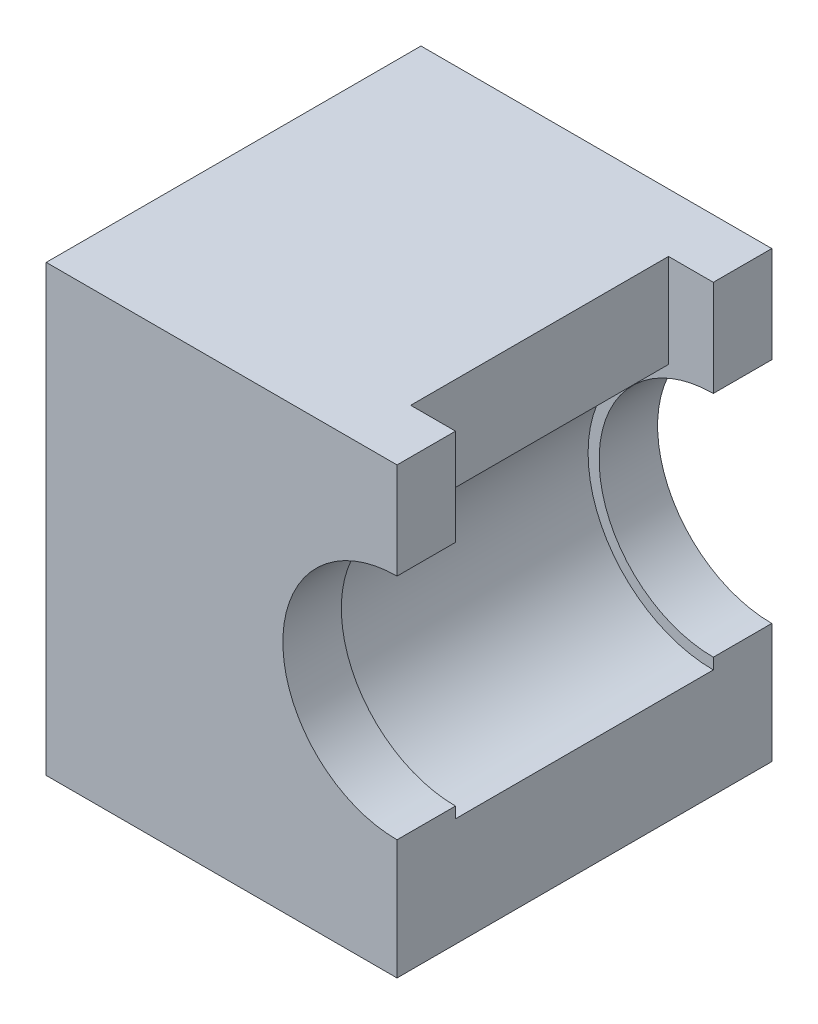
ISO-10303-21;
HEADER;
FILE_DESCRIPTION(('STEP AP214'),'2;1');
FILE_NAME('part.step','',(''),(''),'','','');
FILE_SCHEMA(('AUTOMOTIVE_DESIGN { 1 0 10303 214 1 1 1 1 }'));
ENDSEC;
DATA;
#1=APPLICATION_CONTEXT('core data for automotive mechanical design processes');
#2=APPLICATION_PROTOCOL_DEFINITION('international standard','automotive_design',2000,#1);
#3=PRODUCT_CONTEXT('',#1,'mechanical');
#4=PRODUCT('Part','Part','',(#3));
#5=PRODUCT_RELATED_PRODUCT_CATEGORY('part','',(#4));
#6=PRODUCT_DEFINITION_FORMATION('','',#4);
#7=PRODUCT_DEFINITION_CONTEXT('part definition',#1,'design');
#8=PRODUCT_DEFINITION('design','',#6,#7);
#9=PRODUCT_DEFINITION_SHAPE('','',#8);
#10=(LENGTH_UNIT() NAMED_UNIT(*) SI_UNIT(.MILLI.,.METRE.));
#11=(NAMED_UNIT(*) PLANE_ANGLE_UNIT() SI_UNIT($,.RADIAN.));
#12=(NAMED_UNIT(*) SI_UNIT($,.STERADIAN.) SOLID_ANGLE_UNIT());
#13=UNCERTAINTY_MEASURE_WITH_UNIT(LENGTH_MEASURE(1.E-05),#10,'distance_accuracy_value','');
#14=(GEOMETRIC_REPRESENTATION_CONTEXT(3) GLOBAL_UNCERTAINTY_ASSIGNED_CONTEXT((#13)) GLOBAL_UNIT_ASSIGNED_CONTEXT((#10,
#11,#12)) REPRESENTATION_CONTEXT('',''));
#15=CARTESIAN_POINT('',(0.,0.,0.));
#16=DIRECTION('',(0.,0.,1.));
#17=DIRECTION('',(1.,0.,0.));
#18=AXIS2_PLACEMENT_3D('',#15,#16,#17);
#19=CARTESIAN_POINT('',(0.,-6.35,7.));
#20=DIRECTION('',(0.,1.,0.));
#21=DIRECTION('',(0.,0.,1.));
#22=AXIS2_PLACEMENT_3D('',#19,#20,#21);
#23=PLANE('',#22);
#24=DIRECTION('',(0.,0.,-1.));
#25=VECTOR('',#24,1.);
#26=CARTESIAN_POINT('',(-9.525,-6.35,7.));
#27=LINE('',#26,#25);
#28=CARTESIAN_POINT('',(-9.525,-6.35,8.5875));
#29=VERTEX_POINT('',#28);
#30=CARTESIAN_POINT('',(-9.525,-6.35,-1.5875));
#31=VERTEX_POINT('',#30);
#32=EDGE_CURVE('E212',#29,#31,#27,.T.);
#33=ORIENTED_EDGE('',*,*,#32,.T.);
#34=DIRECTION('',(1.,0.,0.));
#35=VECTOR('',#34,1.);
#36=CARTESIAN_POINT('',(0.,-6.35,-1.5875));
#37=LINE('',#36,#35);
#38=CARTESIAN_POINT('',(0.,-6.35,-1.5875));
#39=VERTEX_POINT('',#38);
#40=EDGE_CURVE('E214',#31,#39,#37,.T.);
#41=ORIENTED_EDGE('',*,*,#40,.T.);
#42=DIRECTION('',(0.,0.,-1.));
#43=VECTOR('',#42,1.);
#44=CARTESIAN_POINT('',(0.,-6.35,7.));
#45=LINE('',#44,#43);
#46=CARTESIAN_POINT('',(0.,-6.35,8.5875));
#47=VERTEX_POINT('',#46);
#48=EDGE_CURVE('E128',#47,#39,#45,.T.);
#49=ORIENTED_EDGE('',*,*,#48,.F.);
#50=DIRECTION('',(1.,0.,0.));
#51=VECTOR('',#50,1.);
#52=CARTESIAN_POINT('',(0.,-6.35,8.5875));
#53=LINE('',#52,#51);
#54=EDGE_CURVE('E217',#29,#47,#53,.T.);
#55=ORIENTED_EDGE('',*,*,#54,.F.);
#56=EDGE_LOOP('',(#33,#41,#49,#55));
#57=FACE_BOUND('',#56,.T.);
#58=ADVANCED_FACE('F118',(#57),#23,.F.);
#59=CARTESIAN_POINT('',(0.,0.,7.));
#60=DIRECTION('',(-1.,0.,0.));
#61=DIRECTION('',(0.,0.,1.));
#62=AXIS2_PLACEMENT_3D('',#59,#60,#61);
#63=PLANE('',#62);
#64=ORIENTED_EDGE('',*,*,#48,.T.);
#65=DIRECTION('',(0.,1.,0.));
#66=VECTOR('',#65,1.);
#67=CARTESIAN_POINT('',(0.,0.,-1.5875));
#68=LINE('',#67,#66);
#69=CARTESIAN_POINT('',(0.,-3.10000000000001,-1.5875));
#70=VERTEX_POINT('',#69);
#71=EDGE_CURVE('E231',#39,#70,#68,.T.);
#72=ORIENTED_EDGE('',*,*,#71,.T.);
#73=DIRECTION('',(0.,0.,1.));
#74=VECTOR('',#73,1.);
#75=CARTESIAN_POINT('',(0.,-3.10000000000001,-1.5875));
#76=LINE('',#75,#74);
#77=CARTESIAN_POINT('',(0.,-3.10000000000001,0.));
#78=VERTEX_POINT('',#77);
#79=EDGE_CURVE('E244',#70,#78,#76,.T.);
#80=ORIENTED_EDGE('',*,*,#79,.T.);
#81=DIRECTION('',(0.,1.,0.));
#82=VECTOR('',#81,1.);
#83=CARTESIAN_POINT('',(0.,0.,0.));
#84=LINE('',#83,#82);
#85=CARTESIAN_POINT('',(0.,-3.4,0.));
#86=VERTEX_POINT('',#85);
#87=EDGE_CURVE('E232',#86,#78,#84,.T.);
#88=ORIENTED_EDGE('',*,*,#87,.F.);
#89=DIRECTION('',(0.,0.,-1.));
#90=VECTOR('',#89,1.);
#91=CARTESIAN_POINT('',(0.,-3.4,7.));
#92=LINE('',#91,#90);
#93=CARTESIAN_POINT('',(0.,-3.4,7.));
#94=VERTEX_POINT('',#93);
#95=EDGE_CURVE('E137',#94,#86,#92,.T.);
#96=ORIENTED_EDGE('',*,*,#95,.F.);
#97=DIRECTION('',(0.,1.,0.));
#98=VECTOR('',#97,1.);
#99=CARTESIAN_POINT('',(0.,0.,7.));
#100=LINE('',#99,#98);
#101=CARTESIAN_POINT('',(0.,-3.10000000000001,7.));
#102=VERTEX_POINT('',#101);
#103=EDGE_CURVE('E261',#94,#102,#100,.T.);
#104=ORIENTED_EDGE('',*,*,#103,.T.);
#105=DIRECTION('',(0.,0.,-1.));
#106=VECTOR('',#105,1.);
#107=CARTESIAN_POINT('',(0.,-3.10000000000001,8.5875));
#108=LINE('',#107,#106);
#109=CARTESIAN_POINT('',(0.,-3.10000000000001,8.5875));
#110=VERTEX_POINT('',#109);
#111=EDGE_CURVE('E290',#110,#102,#108,.T.);
#112=ORIENTED_EDGE('',*,*,#111,.F.);
#113=DIRECTION('',(0.,1.,0.));
#114=VECTOR('',#113,1.);
#115=CARTESIAN_POINT('',(0.,0.,8.5875));
#116=LINE('',#115,#114);
#117=EDGE_CURVE('E263',#47,#110,#116,.T.);
#118=ORIENTED_EDGE('',*,*,#117,.F.);
#119=EDGE_LOOP('',(#64,#72,#80,#88,#96,#104,#112,#118));
#120=FACE_BOUND('',#119,.T.);
#121=ADVANCED_FACE('F341',(#120),#63,.F.);
#122=CARTESIAN_POINT('',(0.,0.,7.));
#123=DIRECTION('',(0.,0.,-1.));
#124=DIRECTION('',(-1.,0.,0.));
#125=AXIS2_PLACEMENT_3D('',#122,#123,#124);
#126=CYLINDRICAL_SURFACE('',#125,3.4);
#127=CARTESIAN_POINT('',(0.,0.,0.));
#128=DIRECTION('',(0.,0.,1.));
#129=DIRECTION('',(1.,0.,0.));
#130=AXIS2_PLACEMENT_3D('',#127,#128,#129);
#131=CIRCLE('',#130,3.4);
#132=CARTESIAN_POINT('',(-1.21629560551701,3.175,0.));
#133=VERTEX_POINT('',#132);
#134=EDGE_CURVE('E222',#133,#86,#131,.T.);
#135=ORIENTED_EDGE('',*,*,#134,.F.);
#136=DIRECTION('',(0.,0.,-1.));
#137=VECTOR('',#136,1.);
#138=CARTESIAN_POINT('',(-1.21629560551701,3.175,7.));
#139=LINE('',#138,#137);
#140=CARTESIAN_POINT('',(-1.21629560551701,3.175,7.));
#141=VERTEX_POINT('',#140);
#142=EDGE_CURVE('E12',#141,#133,#139,.T.);
#143=ORIENTED_EDGE('',*,*,#142,.F.);
#144=CARTESIAN_POINT('',(0.,0.,7.));
#145=DIRECTION('',(0.,0.,1.));
#146=DIRECTION('',(1.,0.,0.));
#147=AXIS2_PLACEMENT_3D('',#144,#145,#146);
#148=CIRCLE('',#147,3.4);
#149=EDGE_CURVE('E293',#141,#94,#148,.T.);
#150=ORIENTED_EDGE('',*,*,#149,.T.);
#151=ORIENTED_EDGE('',*,*,#95,.T.);
#152=EDGE_LOOP('',(#135,#143,#150,#151));
#153=FACE_BOUND('',#152,.T.);
#154=ADVANCED_FACE('F336',(#153),#126,.F.);
#155=CARTESIAN_POINT('',(-9.525,3.175,7.));
#156=DIRECTION('',(1.,0.,0.));
#157=DIRECTION('',(0.,0.,-1.));
#158=AXIS2_PLACEMENT_3D('',#155,#156,#157);
#159=PLANE('',#158);
#160=DIRECTION('',(0.,0.,-1.));
#161=VECTOR('',#160,1.);
#162=CARTESIAN_POINT('',(-9.525,5.715,7.));
#163=LINE('',#162,#161);
#164=CARTESIAN_POINT('',(-9.525,5.715,8.5875));
#165=VERTEX_POINT('',#164);
#166=CARTESIAN_POINT('',(-9.525,5.715,-1.5875));
#167=VERTEX_POINT('',#166);
#168=EDGE_CURVE('E122',#165,#167,#163,.T.);
#169=ORIENTED_EDGE('',*,*,#168,.T.);
#170=DIRECTION('',(0.,-1.,0.));
#171=VECTOR('',#170,1.);
#172=CARTESIAN_POINT('',(-9.525,0.,-1.5875));
#173=LINE('',#172,#171);
#174=EDGE_CURVE('E228',#167,#31,#173,.T.);
#175=ORIENTED_EDGE('',*,*,#174,.T.);
#176=ORIENTED_EDGE('',*,*,#32,.F.);
#177=DIRECTION('',(0.,-1.,0.));
#178=VECTOR('',#177,1.);
#179=CARTESIAN_POINT('',(-9.525,0.,8.5875));
#180=LINE('',#179,#178);
#181=EDGE_CURVE('E275',#165,#29,#180,.T.);
#182=ORIENTED_EDGE('',*,*,#181,.F.);
#183=EDGE_LOOP('',(#169,#175,#176,#182));
#184=FACE_BOUND('',#183,.T.);
#185=ADVANCED_FACE('F234',(#184),#159,.F.);
#186=CARTESIAN_POINT('',(-1.21629560551701,3.175,7.));
#187=DIRECTION('',(-1.,0.,0.));
#188=DIRECTION('',(0.,0.,1.));
#189=AXIS2_PLACEMENT_3D('',#186,#187,#188);
#190=PLANE('',#189);
#191=DIRECTION('',(0.,1.,0.));
#192=VECTOR('',#191,1.);
#193=CARTESIAN_POINT('',(-1.21629560551701,3.175,0.));
#194=LINE('',#193,#192);
#195=CARTESIAN_POINT('',(-1.21629560551701,5.715,0.));
#196=VERTEX_POINT('',#195);
#197=EDGE_CURVE('E150',#133,#196,#194,.T.);
#198=ORIENTED_EDGE('',*,*,#197,.T.);
#199=DIRECTION('',(0.,0.,-1.));
#200=VECTOR('',#199,1.);
#201=CARTESIAN_POINT('',(-1.21629560551701,5.715,7.));
#202=LINE('',#201,#200);
#203=CARTESIAN_POINT('',(-1.21629560551701,5.715,7.));
#204=VERTEX_POINT('',#203);
#205=EDGE_CURVE('E153',#204,#196,#202,.T.);
#206=ORIENTED_EDGE('',*,*,#205,.F.);
#207=DIRECTION('',(0.,1.,0.));
#208=VECTOR('',#207,1.);
#209=CARTESIAN_POINT('',(-1.21629560551701,3.175,7.));
#210=LINE('',#209,#208);
#211=EDGE_CURVE('E299',#141,#204,#210,.T.);
#212=ORIENTED_EDGE('',*,*,#211,.F.);
#213=ORIENTED_EDGE('',*,*,#142,.T.);
#214=EDGE_LOOP('',(#198,#206,#212,#213));
#215=FACE_BOUND('',#214,.T.);
#216=ADVANCED_FACE('F329',(#215),#190,.F.);
#217=CARTESIAN_POINT('',(-1.21629560551701,5.715,7.));
#218=DIRECTION('',(0.,-1.,0.));
#219=DIRECTION('',(1.,0.,0.));
#220=AXIS2_PLACEMENT_3D('',#217,#218,#219);
#221=PLANE('',#220);
#222=ORIENTED_EDGE('',*,*,#205,.T.);
#223=DIRECTION('',(-1.,0.,0.));
#224=VECTOR('',#223,1.);
#225=CARTESIAN_POINT('',(0.,5.715,0.));
#226=LINE('',#225,#224);
#227=CARTESIAN_POINT('',(0.,5.715,0.));
#228=VERTEX_POINT('',#227);
#229=EDGE_CURVE('E245',#228,#196,#226,.T.);
#230=ORIENTED_EDGE('',*,*,#229,.F.);
#231=DIRECTION('',(0.,0.,1.));
#232=VECTOR('',#231,1.);
#233=CARTESIAN_POINT('',(0.,5.715,-1.5875));
#234=LINE('',#233,#232);
#235=CARTESIAN_POINT('',(0.,5.715,-1.5875));
#236=VERTEX_POINT('',#235);
#237=EDGE_CURVE('E259',#236,#228,#234,.T.);
#238=ORIENTED_EDGE('',*,*,#237,.F.);
#239=DIRECTION('',(-1.,0.,0.));
#240=VECTOR('',#239,1.);
#241=CARTESIAN_POINT('',(0.,5.715,-1.5875));
#242=LINE('',#241,#240);
#243=EDGE_CURVE('E235',#236,#167,#242,.T.);
#244=ORIENTED_EDGE('',*,*,#243,.T.);
#245=ORIENTED_EDGE('',*,*,#168,.F.);
#246=DIRECTION('',(-1.,0.,0.));
#247=VECTOR('',#246,1.);
#248=CARTESIAN_POINT('',(0.,5.715,8.5875));
#249=LINE('',#248,#247);
#250=CARTESIAN_POINT('',(0.,5.715,8.5875));
#251=VERTEX_POINT('',#250);
#252=EDGE_CURVE('E272',#251,#165,#249,.T.);
#253=ORIENTED_EDGE('',*,*,#252,.F.);
#254=DIRECTION('',(0.,0.,-1.));
#255=VECTOR('',#254,1.);
#256=CARTESIAN_POINT('',(0.,5.715,8.5875));
#257=LINE('',#256,#255);
#258=CARTESIAN_POINT('',(0.,5.715,7.));
#259=VERTEX_POINT('',#258);
#260=EDGE_CURVE('E277',#251,#259,#257,.T.);
#261=ORIENTED_EDGE('',*,*,#260,.T.);
#262=DIRECTION('',(-1.,0.,0.));
#263=VECTOR('',#262,1.);
#264=CARTESIAN_POINT('',(0.,5.715,7.));
#265=LINE('',#264,#263);
#266=EDGE_CURVE('E264',#259,#204,#265,.T.);
#267=ORIENTED_EDGE('',*,*,#266,.T.);
#268=EDGE_LOOP('',(#222,#230,#238,#244,#245,#253,#261,#267));
#269=FACE_BOUND('',#268,.T.);
#270=ADVANCED_FACE('F120',(#269),#221,.F.);
#271=CARTESIAN_POINT('',(0.,0.,8.5875));
#272=DIRECTION('',(0.,0.,-1.));
#273=DIRECTION('',(-1.,0.,0.));
#274=AXIS2_PLACEMENT_3D('',#271,#272,#273);
#275=CYLINDRICAL_SURFACE('',#274,3.10000000000001);
#276=CARTESIAN_POINT('',(0.,0.,7.));
#277=DIRECTION('',(0.,0.,1.));
#278=DIRECTION('',(1.,0.,0.));
#279=AXIS2_PLACEMENT_3D('',#276,#277,#278);
#280=CIRCLE('',#279,3.10000000000001);
#281=CARTESIAN_POINT('',(0.,3.10000000000001,7.));
#282=VERTEX_POINT('',#281);
#283=EDGE_CURVE('E279',#282,#102,#280,.T.);
#284=ORIENTED_EDGE('',*,*,#283,.F.);
#285=DIRECTION('',(0.,0.,-1.));
#286=VECTOR('',#285,1.);
#287=CARTESIAN_POINT('',(0.,3.10000000000001,8.5875));
#288=LINE('',#287,#286);
#289=CARTESIAN_POINT('',(0.,3.10000000000001,8.5875));
#290=VERTEX_POINT('',#289);
#291=EDGE_CURVE('E288',#290,#282,#288,.T.);
#292=ORIENTED_EDGE('',*,*,#291,.F.);
#293=CARTESIAN_POINT('',(0.,0.,8.5875));
#294=DIRECTION('',(0.,0.,1.));
#295=DIRECTION('',(1.,0.,0.));
#296=AXIS2_PLACEMENT_3D('',#293,#294,#295);
#297=CIRCLE('',#296,3.10000000000001);
#298=EDGE_CURVE('E266',#290,#110,#297,.T.);
#299=ORIENTED_EDGE('',*,*,#298,.T.);
#300=ORIENTED_EDGE('',*,*,#111,.T.);
#301=EDGE_LOOP('',(#284,#292,#299,#300));
#302=FACE_BOUND('',#301,.T.);
#303=ADVANCED_FACE('F335',(#302),#275,.F.);
#304=CARTESIAN_POINT('',(0.,0.,8.5875));
#305=DIRECTION('',(1.,0.,0.));
#306=DIRECTION('',(0.,0.,-1.));
#307=AXIS2_PLACEMENT_3D('',#304,#305,#306);
#308=PLANE('',#307);
#309=DIRECTION('',(0.,-1.,0.));
#310=VECTOR('',#309,1.);
#311=CARTESIAN_POINT('',(0.,0.,7.));
#312=LINE('',#311,#310);
#313=EDGE_CURVE('E282',#259,#282,#312,.T.);
#314=ORIENTED_EDGE('',*,*,#313,.F.);
#315=ORIENTED_EDGE('',*,*,#260,.F.);
#316=DIRECTION('',(0.,-1.,0.));
#317=VECTOR('',#316,1.);
#318=CARTESIAN_POINT('',(0.,0.,8.5875));
#319=LINE('',#318,#317);
#320=EDGE_CURVE('E269',#251,#290,#319,.T.);
#321=ORIENTED_EDGE('',*,*,#320,.T.);
#322=ORIENTED_EDGE('',*,*,#291,.T.);
#323=EDGE_LOOP('',(#314,#315,#321,#322));
#324=FACE_BOUND('',#323,.T.);
#325=ADVANCED_FACE('F323',(#324),#308,.T.);
#326=CARTESIAN_POINT('',(0.,0.,8.5875));
#327=DIRECTION('',(0.,0.,1.));
#328=DIRECTION('',(1.,0.,0.));
#329=AXIS2_PLACEMENT_3D('',#326,#327,#328);
#330=PLANE('',#329);
#331=ORIENTED_EDGE('',*,*,#54,.T.);
#332=ORIENTED_EDGE('',*,*,#117,.T.);
#333=ORIENTED_EDGE('',*,*,#298,.F.);
#334=ORIENTED_EDGE('',*,*,#320,.F.);
#335=ORIENTED_EDGE('',*,*,#252,.T.);
#336=ORIENTED_EDGE('',*,*,#181,.T.);
#337=EDGE_LOOP('',(#331,#332,#333,#334,#335,#336));
#338=FACE_BOUND('',#337,.T.);
#339=ADVANCED_FACE('F319',(#338),#330,.T.);
#340=CARTESIAN_POINT('',(0.,0.,7.));
#341=DIRECTION('',(0.,0.,1.));
#342=DIRECTION('',(1.,0.,0.));
#343=AXIS2_PLACEMENT_3D('',#340,#341,#342);
#344=PLANE('',#343);
#345=ORIENTED_EDGE('',*,*,#149,.F.);
#346=ORIENTED_EDGE('',*,*,#211,.T.);
#347=ORIENTED_EDGE('',*,*,#266,.F.);
#348=ORIENTED_EDGE('',*,*,#313,.T.);
#349=ORIENTED_EDGE('',*,*,#283,.T.);
#350=ORIENTED_EDGE('',*,*,#103,.F.);
#351=EDGE_LOOP('',(#345,#346,#347,#348,#349,#350));
#352=FACE_BOUND('',#351,.T.);
#353=ADVANCED_FACE('F327',(#352),#344,.F.);
#354=CARTESIAN_POINT('',(0.,0.,-1.5875));
#355=DIRECTION('',(-1.,0.,0.));
#356=DIRECTION('',(0.,0.,1.));
#357=AXIS2_PLACEMENT_3D('',#354,#355,#356);
#358=PLANE('',#357);
#359=DIRECTION('',(0.,-1.,0.));
#360=VECTOR('',#359,1.);
#361=CARTESIAN_POINT('',(0.,0.,0.));
#362=LINE('',#361,#360);
#363=CARTESIAN_POINT('',(0.,3.10000000000001,0.));
#364=VERTEX_POINT('',#363);
#365=EDGE_CURVE('E248',#228,#364,#362,.T.);
#366=ORIENTED_EDGE('',*,*,#365,.T.);
#367=DIRECTION('',(0.,0.,1.));
#368=VECTOR('',#367,1.);
#369=CARTESIAN_POINT('',(0.,3.10000000000001,-1.5875));
#370=LINE('',#369,#368);
#371=CARTESIAN_POINT('',(0.,3.10000000000001,-1.5875));
#372=VERTEX_POINT('',#371);
#373=EDGE_CURVE('E256',#372,#364,#370,.T.);
#374=ORIENTED_EDGE('',*,*,#373,.F.);
#375=DIRECTION('',(0.,-1.,0.));
#376=VECTOR('',#375,1.);
#377=CARTESIAN_POINT('',(0.,0.,-1.5875));
#378=LINE('',#377,#376);
#379=EDGE_CURVE('E237',#236,#372,#378,.T.);
#380=ORIENTED_EDGE('',*,*,#379,.F.);
#381=ORIENTED_EDGE('',*,*,#237,.T.);
#382=EDGE_LOOP('',(#366,#374,#380,#381));
#383=FACE_BOUND('',#382,.T.);
#384=ADVANCED_FACE('F310',(#383),#358,.F.);
#385=CARTESIAN_POINT('',(0.,0.,-1.5875));
#386=DIRECTION('',(0.,0.,1.));
#387=DIRECTION('',(1.,0.,0.));
#388=AXIS2_PLACEMENT_3D('',#385,#386,#387);
#389=CYLINDRICAL_SURFACE('',#388,3.10000000000001);
#390=CARTESIAN_POINT('',(0.,0.,0.));
#391=DIRECTION('',(0.,0.,1.));
#392=DIRECTION('',(1.,0.,0.));
#393=AXIS2_PLACEMENT_3D('',#390,#391,#392);
#394=CIRCLE('',#393,3.10000000000001);
#395=EDGE_CURVE('E250',#364,#78,#394,.T.);
#396=ORIENTED_EDGE('',*,*,#395,.T.);
#397=ORIENTED_EDGE('',*,*,#79,.F.);
#398=CARTESIAN_POINT('',(0.,0.,-1.5875));
#399=DIRECTION('',(0.,0.,1.));
#400=DIRECTION('',(1.,0.,0.));
#401=AXIS2_PLACEMENT_3D('',#398,#399,#400);
#402=CIRCLE('',#401,3.10000000000001);
#403=EDGE_CURVE('E241',#372,#70,#402,.T.);
#404=ORIENTED_EDGE('',*,*,#403,.F.);
#405=ORIENTED_EDGE('',*,*,#373,.T.);
#406=EDGE_LOOP('',(#396,#397,#404,#405));
#407=FACE_BOUND('',#406,.T.);
#408=ADVANCED_FACE('F314',(#407),#389,.F.);
#409=CARTESIAN_POINT('',(0.,0.,-1.5875));
#410=DIRECTION('',(0.,0.,-1.));
#411=DIRECTION('',(1.,0.,0.));
#412=AXIS2_PLACEMENT_3D('',#409,#410,#411);
#413=PLANE('',#412);
#414=ORIENTED_EDGE('',*,*,#40,.F.);
#415=ORIENTED_EDGE('',*,*,#174,.F.);
#416=ORIENTED_EDGE('',*,*,#243,.F.);
#417=ORIENTED_EDGE('',*,*,#379,.T.);
#418=ORIENTED_EDGE('',*,*,#403,.T.);
#419=ORIENTED_EDGE('',*,*,#71,.F.);
#420=EDGE_LOOP('',(#414,#415,#416,#417,#418,#419));
#421=FACE_BOUND('',#420,.T.);
#422=ADVANCED_FACE('F226',(#421),#413,.T.);
#423=CARTESIAN_POINT('',(0.,0.,0.));
#424=DIRECTION('',(0.,0.,-1.));
#425=DIRECTION('',(1.,0.,0.));
#426=AXIS2_PLACEMENT_3D('',#423,#424,#425);
#427=PLANE('',#426);
#428=ORIENTED_EDGE('',*,*,#197,.F.);
#429=ORIENTED_EDGE('',*,*,#134,.T.);
#430=ORIENTED_EDGE('',*,*,#87,.T.);
#431=ORIENTED_EDGE('',*,*,#395,.F.);
#432=ORIENTED_EDGE('',*,*,#365,.F.);
#433=ORIENTED_EDGE('',*,*,#229,.T.);
#434=EDGE_LOOP('',(#428,#429,#430,#431,#432,#433));
#435=FACE_BOUND('',#434,.T.);
#436=ADVANCED_FACE('F306',(#435),#427,.F.);
#437=CLOSED_SHELL('',(#58,#121,#154,#185,#216,#270,#303,#325,#339,#353,#384,#408,#422,#436));
#438=MANIFOLD_SOLID_BREP('B2',#437);
#439=ADVANCED_BREP_SHAPE_REPRESENTATION('',(#18,#438),#14);
#440=SHAPE_DEFINITION_REPRESENTATION(#9,#439);
ENDSEC;
END-ISO-10303-21;
